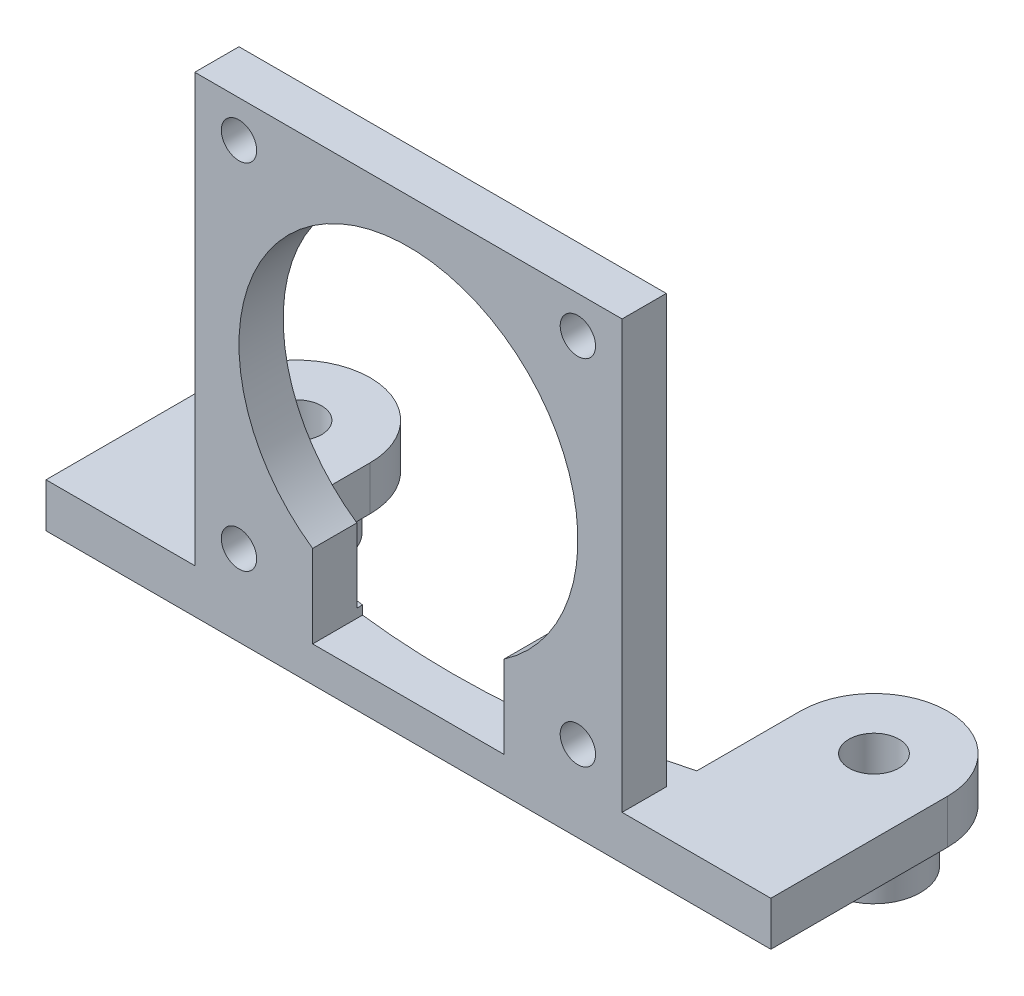
ISO-10303-21;
HEADER;
FILE_DESCRIPTION(('STEP AP214'),'2;1');
FILE_NAME('part.step','',(''),(''),'','','');
FILE_SCHEMA(('AUTOMOTIVE_DESIGN { 1 0 10303 214 1 1 1 1 }'));
ENDSEC;
DATA;
#1=APPLICATION_CONTEXT('core data for automotive mechanical design processes');
#2=APPLICATION_PROTOCOL_DEFINITION('international standard','automotive_design',2000,#1);
#3=PRODUCT_CONTEXT('',#1,'mechanical');
#4=PRODUCT('Part','Part','',(#3));
#5=PRODUCT_RELATED_PRODUCT_CATEGORY('part','',(#4));
#6=PRODUCT_DEFINITION_FORMATION('','',#4);
#7=PRODUCT_DEFINITION_CONTEXT('part definition',#1,'design');
#8=PRODUCT_DEFINITION('design','',#6,#7);
#9=PRODUCT_DEFINITION_SHAPE('','',#8);
#10=(LENGTH_UNIT() NAMED_UNIT(*) SI_UNIT(.MILLI.,.METRE.));
#11=(NAMED_UNIT(*) PLANE_ANGLE_UNIT() SI_UNIT($,.RADIAN.));
#12=(NAMED_UNIT(*) SI_UNIT($,.STERADIAN.) SOLID_ANGLE_UNIT());
#13=UNCERTAINTY_MEASURE_WITH_UNIT(LENGTH_MEASURE(1.E-05),#10,'distance_accuracy_value','');
#14=(GEOMETRIC_REPRESENTATION_CONTEXT(3) GLOBAL_UNCERTAINTY_ASSIGNED_CONTEXT((#13)) GLOBAL_UNIT_ASSIGNED_CONTEXT((#10,
#11,#12)) REPRESENTATION_CONTEXT('',''));
#15=CARTESIAN_POINT('',(0.,0.,0.));
#16=DIRECTION('',(0.,0.,1.));
#17=DIRECTION('',(1.,0.,0.));
#18=AXIS2_PLACEMENT_3D('',#15,#16,#17);
#19=CARTESIAN_POINT('',(0.,0.,0.));
#20=DIRECTION('',(0.,1.,0.));
#21=DIRECTION('',(0.,0.,1.));
#22=AXIS2_PLACEMENT_3D('',#19,#20,#21);
#23=PLANE('',#22);
#24=CARTESIAN_POINT('',(-19.5959179422654,0.,46.));
#25=DIRECTION('',(0.,1.,0.));
#26=DIRECTION('',(0.,0.,1.));
#27=AXIS2_PLACEMENT_3D('',#24,#25,#26);
#28=CIRCLE('',#27,1.7);
#29=CARTESIAN_POINT('',(-19.5959179422654,0.,47.7));
#30=VERTEX_POINT('',#29);
#31=EDGE_CURVE('E329',#30,#30,#28,.T.);
#32=ORIENTED_EDGE('',*,*,#31,.F.);
#33=EDGE_LOOP('',(#32));
#34=FACE_BOUND('',#33,.T.);
#35=DIRECTION('',(-1.,0.,0.));
#36=VECTOR('',#35,1.);
#37=CARTESIAN_POINT('',(0.,0.,55.));
#38=LINE('',#37,#36);
#39=CARTESIAN_POINT('',(-6.5,0.,55.));
#40=VERTEX_POINT('',#39);
#41=CARTESIAN_POINT('',(-14.5,0.,55.));
#42=VERTEX_POINT('',#41);
#43=EDGE_CURVE('E12',#40,#42,#38,.T.);
#44=ORIENTED_EDGE('',*,*,#43,.F.);
#45=DIRECTION('',(0.,0.,1.));
#46=VECTOR('',#45,1.);
#47=CARTESIAN_POINT('',(-6.5,0.,40.999));
#48=LINE('',#47,#46);
#49=CARTESIAN_POINT('',(-6.5,0.,54.6145584986274));
#50=VERTEX_POINT('',#49);
#51=EDGE_CURVE('E136',#50,#40,#48,.T.);
#52=ORIENTED_EDGE('',*,*,#51,.F.);
#53=CARTESIAN_POINT('',(0.,0.,0.));
#54=DIRECTION('',(0.,1.,0.));
#55=DIRECTION('',(0.,0.,1.));
#56=AXIS2_PLACEMENT_3D('',#53,#54,#55);
#57=CIRCLE('',#56,55.);
#58=CARTESIAN_POINT('',(-14.5959179422654,0.,53.0279094385462));
#59=VERTEX_POINT('',#58);
#60=EDGE_CURVE('E318',#59,#50,#57,.T.);
#61=ORIENTED_EDGE('',*,*,#60,.F.);
#62=DIRECTION('',(0.,0.,1.));
#63=VECTOR('',#62,1.);
#64=CARTESIAN_POINT('',(-14.5959179422655,0.,0.));
#65=LINE('',#64,#63);
#66=CARTESIAN_POINT('',(-14.5959179422654,0.,46.));
#67=VERTEX_POINT('',#66);
#68=EDGE_CURVE('E321',#67,#59,#65,.T.);
#69=ORIENTED_EDGE('',*,*,#68,.F.);
#70=CARTESIAN_POINT('',(-19.5959179422654,0.,46.));
#71=DIRECTION('',(0.,1.,0.));
#72=DIRECTION('',(0.,0.,1.));
#73=AXIS2_PLACEMENT_3D('',#70,#71,#72);
#74=CIRCLE('',#73,5.);
#75=CARTESIAN_POINT('',(-24.5959179422654,0.,46.));
#76=VERTEX_POINT('',#75);
#77=EDGE_CURVE('E323',#67,#76,#74,.T.);
#78=ORIENTED_EDGE('',*,*,#77,.T.);
#79=DIRECTION('',(0.,0.,1.));
#80=VECTOR('',#79,1.);
#81=CARTESIAN_POINT('',(-24.5959179422654,0.,0.));
#82=LINE('',#81,#80);
#83=CARTESIAN_POINT('',(-24.5959179422654,0.,58.));
#84=VERTEX_POINT('',#83);
#85=EDGE_CURVE('E326',#76,#84,#82,.T.);
#86=ORIENTED_EDGE('',*,*,#85,.T.);
#87=DIRECTION('',(1.,0.,0.));
#88=VECTOR('',#87,1.);
#89=CARTESIAN_POINT('',(0.,0.,58.));
#90=LINE('',#89,#88);
#91=CARTESIAN_POINT('',(-14.5,0.,58.));
#92=VERTEX_POINT('',#91);
#93=EDGE_CURVE('E309',#84,#92,#90,.T.);
#94=ORIENTED_EDGE('',*,*,#93,.T.);
#95=DIRECTION('',(0.,0.,-1.));
#96=VECTOR('',#95,1.);
#97=CARTESIAN_POINT('',(-14.5,0.,0.));
#98=LINE('',#97,#96);
#99=EDGE_CURVE('E268',#92,#42,#98,.T.);
#100=ORIENTED_EDGE('',*,*,#99,.T.);
#101=EDGE_LOOP('',(#44,#52,#61,#69,#78,#86,#94,#100));
#102=FACE_BOUND('',#101,.T.);
#103=ADVANCED_FACE('F111',(#34,#102),#23,.T.);
#104=CARTESIAN_POINT('',(0.,-3.,58.));
#105=DIRECTION('',(0.,0.,1.));
#106=DIRECTION('',(1.,0.,0.));
#107=AXIS2_PLACEMENT_3D('',#104,#105,#106);
#108=PLANE('',#107);
#109=ORIENTED_EDGE('',*,*,#93,.F.);
#110=DIRECTION('',(0.,1.,0.));
#111=VECTOR('',#110,1.);
#112=CARTESIAN_POINT('',(-24.5959179422654,-3.,58.));
#113=LINE('',#112,#111);
#114=CARTESIAN_POINT('',(-24.5959179422654,-3.,58.));
#115=VERTEX_POINT('',#114);
#116=EDGE_CURVE('E120',#115,#84,#113,.T.);
#117=ORIENTED_EDGE('',*,*,#116,.F.);
#118=DIRECTION('',(1.,0.,0.));
#119=VECTOR('',#118,1.);
#120=CARTESIAN_POINT('',(0.,-3.,58.));
#121=LINE('',#120,#119);
#122=CARTESIAN_POINT('',(24.5959179422654,-3.,58.));
#123=VERTEX_POINT('',#122);
#124=EDGE_CURVE('E288',#115,#123,#121,.T.);
#125=ORIENTED_EDGE('',*,*,#124,.T.);
#126=DIRECTION('',(0.,1.,0.));
#127=VECTOR('',#126,1.);
#128=CARTESIAN_POINT('',(24.5959179422654,-3.,58.));
#129=LINE('',#128,#127);
#130=CARTESIAN_POINT('',(24.5959179422654,0.,58.));
#131=VERTEX_POINT('',#130);
#132=EDGE_CURVE('E115',#123,#131,#129,.T.);
#133=ORIENTED_EDGE('',*,*,#132,.T.);
#134=CARTESIAN_POINT('',(14.5,0.,58.));
#135=VERTEX_POINT('',#134);
#136=EDGE_CURVE('E279',#135,#131,#90,.T.);
#137=ORIENTED_EDGE('',*,*,#136,.F.);
#138=DIRECTION('',(0.,-1.,0.));
#139=VECTOR('',#138,1.);
#140=CARTESIAN_POINT('',(14.5,29.,58.));
#141=LINE('',#140,#139);
#142=CARTESIAN_POINT('',(14.5,29.,58.));
#143=VERTEX_POINT('',#142);
#144=EDGE_CURVE('E280',#143,#135,#141,.T.);
#145=ORIENTED_EDGE('',*,*,#144,.F.);
#146=DIRECTION('',(-1.,0.,0.));
#147=VECTOR('',#146,1.);
#148=CARTESIAN_POINT('',(0.,29.,58.));
#149=LINE('',#148,#147);
#150=CARTESIAN_POINT('',(-14.5,29.,58.));
#151=VERTEX_POINT('',#150);
#152=EDGE_CURVE('E287',#143,#151,#149,.T.);
#153=ORIENTED_EDGE('',*,*,#152,.T.);
#154=DIRECTION('',(0.,-1.,0.));
#155=VECTOR('',#154,1.);
#156=CARTESIAN_POINT('',(-14.5,29.,58.));
#157=LINE('',#156,#155);
#158=EDGE_CURVE('E276',#151,#92,#157,.T.);
#159=ORIENTED_EDGE('',*,*,#158,.T.);
#160=EDGE_LOOP('',(#109,#117,#125,#133,#137,#145,#153,#159));
#161=FACE_BOUND('',#160,.T.);
#162=CARTESIAN_POINT('',(11.5,26.5,58.));
#163=DIRECTION('',(0.,0.,1.));
#164=DIRECTION('',(1.,0.,0.));
#165=AXIS2_PLACEMENT_3D('',#162,#163,#164);
#166=CIRCLE('',#165,1.2);
#167=CARTESIAN_POINT('',(12.7,26.5,58.));
#168=VERTEX_POINT('',#167);
#169=EDGE_CURVE('E272',#168,#168,#166,.F.);
#170=ORIENTED_EDGE('',*,*,#169,.T.);
#171=EDGE_LOOP('',(#170));
#172=FACE_BOUND('',#171,.T.);
#173=CARTESIAN_POINT('',(11.5,2.49999999999995,58.));
#174=DIRECTION('',(0.,0.,1.));
#175=DIRECTION('',(1.,0.,0.));
#176=AXIS2_PLACEMENT_3D('',#173,#174,#175);
#177=CIRCLE('',#176,1.2);
#178=CARTESIAN_POINT('',(12.7,2.49999999999995,58.));
#179=VERTEX_POINT('',#178);
#180=EDGE_CURVE('E390',#179,#179,#177,.F.);
#181=ORIENTED_EDGE('',*,*,#180,.T.);
#182=EDGE_LOOP('',(#181));
#183=FACE_BOUND('',#182,.T.);
#184=CARTESIAN_POINT('',(0.,14.5,58.));
#185=DIRECTION('',(0.,0.,1.));
#186=DIRECTION('',(1.,0.,0.));
#187=AXIS2_PLACEMENT_3D('',#184,#185,#186);
#188=CIRCLE('',#187,11.5);
#189=CARTESIAN_POINT('',(6.5,5.01316701949481,58.));
#190=VERTEX_POINT('',#189);
#191=CARTESIAN_POINT('',(-6.5,5.01316701949483,58.));
#192=VERTEX_POINT('',#191);
#193=EDGE_CURVE('E417',#190,#192,#188,.T.);
#194=ORIENTED_EDGE('',*,*,#193,.F.);
#195=DIRECTION('',(0.,1.,0.));
#196=VECTOR('',#195,1.);
#197=CARTESIAN_POINT('',(6.5,0.,58.));
#198=LINE('',#197,#196);
#199=CARTESIAN_POINT('',(6.5,-0.6,58.));
#200=VERTEX_POINT('',#199);
#201=EDGE_CURVE('E407',#200,#190,#198,.T.);
#202=ORIENTED_EDGE('',*,*,#201,.F.);
#203=DIRECTION('',(1.,0.,0.));
#204=VECTOR('',#203,1.);
#205=CARTESIAN_POINT('',(0.,-0.6,58.));
#206=LINE('',#205,#204);
#207=CARTESIAN_POINT('',(-6.5,-0.6,58.));
#208=VERTEX_POINT('',#207);
#209=EDGE_CURVE('E413',#208,#200,#206,.T.);
#210=ORIENTED_EDGE('',*,*,#209,.F.);
#211=DIRECTION('',(0.,1.,0.));
#212=VECTOR('',#211,1.);
#213=CARTESIAN_POINT('',(-6.5,0.,58.));
#214=LINE('',#213,#212);
#215=EDGE_CURVE('E129',#208,#192,#214,.T.);
#216=ORIENTED_EDGE('',*,*,#215,.T.);
#217=EDGE_LOOP('',(#194,#202,#210,#216));
#218=FACE_BOUND('',#217,.T.);
#219=CARTESIAN_POINT('',(-11.5,2.49999999999995,58.));
#220=DIRECTION('',(0.,0.,1.));
#221=DIRECTION('',(1.,0.,0.));
#222=AXIS2_PLACEMENT_3D('',#219,#220,#221);
#223=CIRCLE('',#222,1.2);
#224=CARTESIAN_POINT('',(-10.3,2.49999999999995,58.));
#225=VERTEX_POINT('',#224);
#226=EDGE_CURVE('E387',#225,#225,#223,.T.);
#227=ORIENTED_EDGE('',*,*,#226,.F.);
#228=EDGE_LOOP('',(#227));
#229=FACE_BOUND('',#228,.T.);
#230=CARTESIAN_POINT('',(-11.5,26.5,58.));
#231=DIRECTION('',(0.,0.,1.));
#232=DIRECTION('',(1.,0.,0.));
#233=AXIS2_PLACEMENT_3D('',#230,#231,#232);
#234=CIRCLE('',#233,1.2);
#235=CARTESIAN_POINT('',(-10.3,26.5,58.));
#236=VERTEX_POINT('',#235);
#237=EDGE_CURVE('E386',#236,#236,#234,.T.);
#238=ORIENTED_EDGE('',*,*,#237,.F.);
#239=EDGE_LOOP('',(#238));
#240=FACE_BOUND('',#239,.T.);
#241=ADVANCED_FACE('F113',(#161,#172,#183,#218,#229,#240),#108,.T.);
#242=CARTESIAN_POINT('',(0.,29.,55.));
#243=DIRECTION('',(0.,0.,1.));
#244=DIRECTION('',(1.,0.,0.));
#245=AXIS2_PLACEMENT_3D('',#242,#243,#244);
#246=PLANE('',#245);
#247=CARTESIAN_POINT('',(-11.5,2.49999999999995,55.));
#248=DIRECTION('',(0.,0.,1.));
#249=DIRECTION('',(1.,0.,0.));
#250=AXIS2_PLACEMENT_3D('',#247,#248,#249);
#251=CIRCLE('',#250,1.2);
#252=CARTESIAN_POINT('',(-10.3,2.49999999999995,55.));
#253=VERTEX_POINT('',#252);
#254=EDGE_CURVE('E383',#253,#253,#251,.F.);
#255=ORIENTED_EDGE('',*,*,#254,.F.);
#256=EDGE_LOOP('',(#255));
#257=FACE_BOUND('',#256,.T.);
#258=CARTESIAN_POINT('',(11.5,2.49999999999995,55.));
#259=DIRECTION('',(0.,0.,1.));
#260=DIRECTION('',(1.,0.,0.));
#261=AXIS2_PLACEMENT_3D('',#258,#259,#260);
#262=CIRCLE('',#261,1.2);
#263=CARTESIAN_POINT('',(12.7,2.49999999999995,55.));
#264=VERTEX_POINT('',#263);
#265=EDGE_CURVE('E258',#264,#264,#262,.T.);
#266=ORIENTED_EDGE('',*,*,#265,.T.);
#267=EDGE_LOOP('',(#266));
#268=FACE_BOUND('',#267,.T.);
#269=CARTESIAN_POINT('',(11.5,26.5,55.));
#270=DIRECTION('',(0.,0.,1.));
#271=DIRECTION('',(1.,0.,0.));
#272=AXIS2_PLACEMENT_3D('',#269,#270,#271);
#273=CIRCLE('',#272,1.2);
#274=CARTESIAN_POINT('',(12.7,26.5,55.));
#275=VERTEX_POINT('',#274);
#276=EDGE_CURVE('E377',#275,#275,#273,.T.);
#277=ORIENTED_EDGE('',*,*,#276,.T.);
#278=EDGE_LOOP('',(#277));
#279=FACE_BOUND('',#278,.T.);
#280=CARTESIAN_POINT('',(14.5,0.,55.));
#281=VERTEX_POINT('',#280);
#282=CARTESIAN_POINT('',(6.5,0.,55.));
#283=VERTEX_POINT('',#282);
#284=EDGE_CURVE('E122',#281,#283,#38,.T.);
#285=ORIENTED_EDGE('',*,*,#284,.T.);
#286=DIRECTION('',(0.,-1.,0.));
#287=VECTOR('',#286,1.);
#288=CARTESIAN_POINT('',(6.5,0.,55.));
#289=LINE('',#288,#287);
#290=CARTESIAN_POINT('',(6.5,5.01316701949481,55.));
#291=VERTEX_POINT('',#290);
#292=EDGE_CURVE('E238',#291,#283,#289,.T.);
#293=ORIENTED_EDGE('',*,*,#292,.F.);
#294=CARTESIAN_POINT('',(0.,14.5,55.));
#295=DIRECTION('',(0.,0.,1.));
#296=DIRECTION('',(1.,0.,0.));
#297=AXIS2_PLACEMENT_3D('',#294,#295,#296);
#298=CIRCLE('',#297,11.5);
#299=CARTESIAN_POINT('',(-6.5,5.01316701949483,55.));
#300=VERTEX_POINT('',#299);
#301=EDGE_CURVE('E249',#300,#291,#298,.F.);
#302=ORIENTED_EDGE('',*,*,#301,.F.);
#303=DIRECTION('',(0.,-1.,0.));
#304=VECTOR('',#303,1.);
#305=CARTESIAN_POINT('',(-6.5,0.,55.));
#306=LINE('',#305,#304);
#307=EDGE_CURVE('E402',#300,#40,#306,.T.);
#308=ORIENTED_EDGE('',*,*,#307,.T.);
#309=ORIENTED_EDGE('',*,*,#43,.T.);
#310=DIRECTION('',(0.,-1.,0.));
#311=VECTOR('',#310,1.);
#312=CARTESIAN_POINT('',(-14.5,29.,55.));
#313=LINE('',#312,#311);
#314=CARTESIAN_POINT('',(-14.5,29.,55.));
#315=VERTEX_POINT('',#314);
#316=EDGE_CURVE('E284',#315,#42,#313,.T.);
#317=ORIENTED_EDGE('',*,*,#316,.F.);
#318=DIRECTION('',(-1.,0.,0.));
#319=VECTOR('',#318,1.);
#320=CARTESIAN_POINT('',(0.,29.,55.));
#321=LINE('',#320,#319);
#322=CARTESIAN_POINT('',(14.5,29.,55.));
#323=VERTEX_POINT('',#322);
#324=EDGE_CURVE('E371',#323,#315,#321,.T.);
#325=ORIENTED_EDGE('',*,*,#324,.F.);
#326=DIRECTION('',(0.,-1.,0.));
#327=VECTOR('',#326,1.);
#328=CARTESIAN_POINT('',(14.5,29.,55.));
#329=LINE('',#328,#327);
#330=EDGE_CURVE('E266',#323,#281,#329,.T.);
#331=ORIENTED_EDGE('',*,*,#330,.T.);
#332=EDGE_LOOP('',(#285,#293,#302,#308,#309,#317,#325,#331));
#333=FACE_BOUND('',#332,.T.);
#334=CARTESIAN_POINT('',(-11.5,26.5,55.));
#335=DIRECTION('',(0.,0.,1.));
#336=DIRECTION('',(1.,0.,0.));
#337=AXIS2_PLACEMENT_3D('',#334,#335,#336);
#338=CIRCLE('',#337,1.2);
#339=CARTESIAN_POINT('',(-10.3,26.5,55.));
#340=VERTEX_POINT('',#339);
#341=EDGE_CURVE('E380',#340,#340,#338,.F.);
#342=ORIENTED_EDGE('',*,*,#341,.F.);
#343=EDGE_LOOP('',(#342));
#344=FACE_BOUND('',#343,.T.);
#345=ADVANCED_FACE('F262',(#257,#268,#279,#333,#344),#246,.F.);
#346=CARTESIAN_POINT('',(-24.5959179422654,-3.,0.));
#347=DIRECTION('',(-1.,0.,0.));
#348=DIRECTION('',(0.,0.,1.));
#349=AXIS2_PLACEMENT_3D('',#346,#347,#348);
#350=PLANE('',#349);
#351=ORIENTED_EDGE('',*,*,#85,.F.);
#352=DIRECTION('',(0.,1.,0.));
#353=VECTOR('',#352,1.);
#354=CARTESIAN_POINT('',(-24.5959179422654,-3.,46.));
#355=LINE('',#354,#353);
#356=CARTESIAN_POINT('',(-24.5959179422654,-3.,46.));
#357=VERTEX_POINT('',#356);
#358=EDGE_CURVE('E335',#357,#76,#355,.T.);
#359=ORIENTED_EDGE('',*,*,#358,.F.);
#360=DIRECTION('',(0.,0.,1.));
#361=VECTOR('',#360,1.);
#362=CARTESIAN_POINT('',(-24.5959179422654,-3.,0.));
#363=LINE('',#362,#361);
#364=EDGE_CURVE('E306',#357,#115,#363,.T.);
#365=ORIENTED_EDGE('',*,*,#364,.T.);
#366=ORIENTED_EDGE('',*,*,#116,.T.);
#367=EDGE_LOOP('',(#351,#359,#365,#366));
#368=FACE_BOUND('',#367,.T.);
#369=ADVANCED_FACE('F482',(#368),#350,.T.);
#370=CARTESIAN_POINT('',(-19.5959179422654,-3.,46.));
#371=DIRECTION('',(0.,1.,0.));
#372=DIRECTION('',(0.,0.,1.));
#373=AXIS2_PLACEMENT_3D('',#370,#371,#372);
#374=CYLINDRICAL_SURFACE('',#373,5.);
#375=ORIENTED_EDGE('',*,*,#77,.F.);
#376=DIRECTION('',(0.,1.,0.));
#377=VECTOR('',#376,1.);
#378=CARTESIAN_POINT('',(-14.5959179422654,-3.,46.));
#379=LINE('',#378,#377);
#380=CARTESIAN_POINT('',(-14.5959179422654,-3.,46.));
#381=VERTEX_POINT('',#380);
#382=EDGE_CURVE('E337',#381,#67,#379,.T.);
#383=ORIENTED_EDGE('',*,*,#382,.F.);
#384=CARTESIAN_POINT('',(-19.5959179422654,-3.,46.));
#385=DIRECTION('',(0.,1.,0.));
#386=DIRECTION('',(0.,0.,1.));
#387=AXIS2_PLACEMENT_3D('',#384,#385,#386);
#388=CIRCLE('',#387,5.);
#389=EDGE_CURVE('E303',#381,#357,#388,.T.);
#390=ORIENTED_EDGE('',*,*,#389,.T.);
#391=ORIENTED_EDGE('',*,*,#358,.T.);
#392=EDGE_LOOP('',(#375,#383,#390,#391));
#393=FACE_BOUND('',#392,.T.);
#394=ADVANCED_FACE('F633',(#393),#374,.T.);
#395=CARTESIAN_POINT('',(-14.5959179422655,-3.,0.));
#396=DIRECTION('',(-1.,0.,0.));
#397=DIRECTION('',(0.,0.,1.));
#398=AXIS2_PLACEMENT_3D('',#395,#396,#397);
#399=PLANE('',#398);
#400=ORIENTED_EDGE('',*,*,#68,.T.);
#401=DIRECTION('',(0.,1.,0.));
#402=VECTOR('',#401,1.);
#403=CARTESIAN_POINT('',(-14.5959179422654,-3.,53.0279094385462));
#404=LINE('',#403,#402);
#405=CARTESIAN_POINT('',(-14.5959179422654,-3.,53.0279094385462));
#406=VERTEX_POINT('',#405);
#407=EDGE_CURVE('E339',#406,#59,#404,.T.);
#408=ORIENTED_EDGE('',*,*,#407,.F.);
#409=DIRECTION('',(0.,0.,1.));
#410=VECTOR('',#409,1.);
#411=CARTESIAN_POINT('',(-14.5959179422655,-3.,0.));
#412=LINE('',#411,#410);
#413=EDGE_CURVE('E301',#381,#406,#412,.T.);
#414=ORIENTED_EDGE('',*,*,#413,.F.);
#415=ORIENTED_EDGE('',*,*,#382,.T.);
#416=EDGE_LOOP('',(#400,#408,#414,#415));
#417=FACE_BOUND('',#416,.T.);
#418=ADVANCED_FACE('F628',(#417),#399,.F.);
#419=CARTESIAN_POINT('',(0.,-3.,0.));
#420=DIRECTION('',(0.,1.,0.));
#421=DIRECTION('',(0.,0.,1.));
#422=AXIS2_PLACEMENT_3D('',#419,#420,#421);
#423=CYLINDRICAL_SURFACE('',#422,55.);
#424=CARTESIAN_POINT('',(0.,-0.6,0.));
#425=DIRECTION('',(0.,-1.,0.));
#426=DIRECTION('',(0.,0.,-1.));
#427=AXIS2_PLACEMENT_3D('',#424,#425,#426);
#428=CIRCLE('',#427,55.);
#429=CARTESIAN_POINT('',(6.5,-0.6,54.6145584986274));
#430=VERTEX_POINT('',#429);
#431=CARTESIAN_POINT('',(-6.5,-0.6,54.6145584986274));
#432=VERTEX_POINT('',#431);
#433=EDGE_CURVE('E248',#430,#432,#428,.T.);
#434=ORIENTED_EDGE('',*,*,#433,.F.);
#435=DIRECTION('',(0.,1.,0.));
#436=VECTOR('',#435,1.);
#437=CARTESIAN_POINT('',(6.5,-3.,54.6145584986274));
#438=LINE('',#437,#436);
#439=CARTESIAN_POINT('',(6.5,0.,54.6145584986274));
#440=VERTEX_POINT('',#439);
#441=EDGE_CURVE('E420',#440,#430,#438,.F.);
#442=ORIENTED_EDGE('',*,*,#441,.F.);
#443=CARTESIAN_POINT('',(14.5959179422654,0.,53.0279094385462));
#444=VERTEX_POINT('',#443);
#445=EDGE_CURVE('E257',#440,#444,#57,.T.);
#446=ORIENTED_EDGE('',*,*,#445,.T.);
#447=DIRECTION('',(0.,1.,0.));
#448=VECTOR('',#447,1.);
#449=CARTESIAN_POINT('',(14.5959179422654,-3.,53.0279094385462));
#450=LINE('',#449,#448);
#451=CARTESIAN_POINT('',(14.5959179422654,-3.,53.0279094385462));
#452=VERTEX_POINT('',#451);
#453=EDGE_CURVE('E342',#452,#444,#450,.T.);
#454=ORIENTED_EDGE('',*,*,#453,.F.);
#455=CARTESIAN_POINT('',(0.,-3.,0.));
#456=DIRECTION('',(0.,1.,0.));
#457=DIRECTION('',(0.,0.,1.));
#458=AXIS2_PLACEMENT_3D('',#455,#456,#457);
#459=CIRCLE('',#458,55.);
#460=EDGE_CURVE('E299',#406,#452,#459,.T.);
#461=ORIENTED_EDGE('',*,*,#460,.F.);
#462=ORIENTED_EDGE('',*,*,#407,.T.);
#463=ORIENTED_EDGE('',*,*,#60,.T.);
#464=DIRECTION('',(0.,1.,0.));
#465=VECTOR('',#464,1.);
#466=CARTESIAN_POINT('',(-6.5,-3.,54.6145584986274));
#467=LINE('',#466,#465);
#468=EDGE_CURVE('E259',#50,#432,#467,.F.);
#469=ORIENTED_EDGE('',*,*,#468,.T.);
#470=EDGE_LOOP('',(#434,#442,#446,#454,#461,#462,#463,#469));
#471=FACE_BOUND('',#470,.T.);
#472=ADVANCED_FACE('F620',(#471),#423,.F.);
#473=CARTESIAN_POINT('',(14.5959179422655,-3.,0.));
#474=DIRECTION('',(-1.,0.,0.));
#475=DIRECTION('',(0.,0.,1.));
#476=AXIS2_PLACEMENT_3D('',#473,#474,#475);
#477=PLANE('',#476);
#478=DIRECTION('',(0.,0.,1.));
#479=VECTOR('',#478,1.);
#480=CARTESIAN_POINT('',(14.5959179422655,0.,0.));
#481=LINE('',#480,#479);
#482=CARTESIAN_POINT('',(14.5959179422656,0.,46.));
#483=VERTEX_POINT('',#482);
#484=EDGE_CURVE('E316',#483,#444,#481,.T.);
#485=ORIENTED_EDGE('',*,*,#484,.F.);
#486=DIRECTION('',(0.,1.,0.));
#487=VECTOR('',#486,1.);
#488=CARTESIAN_POINT('',(14.5959179422656,-3.,46.));
#489=LINE('',#488,#487);
#490=CARTESIAN_POINT('',(14.5959179422656,-3.,46.));
#491=VERTEX_POINT('',#490);
#492=EDGE_CURVE('E345',#491,#483,#489,.T.);
#493=ORIENTED_EDGE('',*,*,#492,.F.);
#494=DIRECTION('',(0.,0.,1.));
#495=VECTOR('',#494,1.);
#496=CARTESIAN_POINT('',(14.5959179422655,-3.,0.));
#497=LINE('',#496,#495);
#498=EDGE_CURVE('E296',#491,#452,#497,.T.);
#499=ORIENTED_EDGE('',*,*,#498,.T.);
#500=ORIENTED_EDGE('',*,*,#453,.T.);
#501=EDGE_LOOP('',(#485,#493,#499,#500));
#502=FACE_BOUND('',#501,.T.);
#503=ADVANCED_FACE('F609',(#502),#477,.T.);
#504=CARTESIAN_POINT('',(19.5959179422654,-3.,46.));
#505=DIRECTION('',(0.,1.,0.));
#506=DIRECTION('',(0.,0.,1.));
#507=AXIS2_PLACEMENT_3D('',#504,#505,#506);
#508=CYLINDRICAL_SURFACE('',#507,4.9999999999997);
#509=CARTESIAN_POINT('',(19.5959179422654,0.,46.));
#510=DIRECTION('',(0.,1.,0.));
#511=DIRECTION('',(0.,0.,1.));
#512=AXIS2_PLACEMENT_3D('',#509,#510,#511);
#513=CIRCLE('',#512,4.9999999999997);
#514=CARTESIAN_POINT('',(24.5959179422653,0.,46.));
#515=VERTEX_POINT('',#514);
#516=EDGE_CURVE('E314',#483,#515,#513,.F.);
#517=ORIENTED_EDGE('',*,*,#516,.T.);
#518=DIRECTION('',(0.,1.,0.));
#519=VECTOR('',#518,1.);
#520=CARTESIAN_POINT('',(24.5959179422653,-3.,46.));
#521=LINE('',#520,#519);
#522=CARTESIAN_POINT('',(24.5959179422653,-3.,46.));
#523=VERTEX_POINT('',#522);
#524=EDGE_CURVE('E346',#523,#515,#521,.T.);
#525=ORIENTED_EDGE('',*,*,#524,.F.);
#526=CARTESIAN_POINT('',(19.5959179422654,-3.,46.));
#527=DIRECTION('',(0.,1.,0.));
#528=DIRECTION('',(0.,0.,1.));
#529=AXIS2_PLACEMENT_3D('',#526,#527,#528);
#530=CIRCLE('',#529,4.9999999999997);
#531=EDGE_CURVE('E294',#491,#523,#530,.F.);
#532=ORIENTED_EDGE('',*,*,#531,.F.);
#533=ORIENTED_EDGE('',*,*,#492,.T.);
#534=EDGE_LOOP('',(#517,#525,#532,#533));
#535=FACE_BOUND('',#534,.T.);
#536=ADVANCED_FACE('F604',(#535),#508,.T.);
#537=CARTESIAN_POINT('',(-19.5959179422654,-3.,46.));
#538=DIRECTION('',(0.,1.,0.));
#539=DIRECTION('',(0.,0.,1.));
#540=AXIS2_PLACEMENT_3D('',#537,#538,#539);
#541=CYLINDRICAL_SURFACE('',#540,1.7);
#542=ORIENTED_EDGE('',*,*,#31,.T.);
#543=EDGE_LOOP('',(#542));
#544=FACE_BOUND('',#543,.T.);
#545=CARTESIAN_POINT('',(-19.5959179422654,-6.6,46.));
#546=DIRECTION('',(0.,1.,0.));
#547=DIRECTION('',(0.,0.,1.));
#548=AXIS2_PLACEMENT_3D('',#545,#546,#547);
#549=CIRCLE('',#548,1.7);
#550=CARTESIAN_POINT('',(-19.5959179422654,-6.6,47.7));
#551=VERTEX_POINT('',#550);
#552=EDGE_CURVE('E428',#551,#551,#549,.T.);
#553=ORIENTED_EDGE('',*,*,#552,.F.);
#554=EDGE_LOOP('',(#553));
#555=FACE_BOUND('',#554,.T.);
#556=ADVANCED_FACE('F457',(#544,#555),#541,.F.);
#557=CARTESIAN_POINT('',(24.5959179422654,-3.,0.));
#558=DIRECTION('',(-1.,0.,0.));
#559=DIRECTION('',(0.,0.,1.));
#560=AXIS2_PLACEMENT_3D('',#557,#558,#559);
#561=PLANE('',#560);
#562=DIRECTION('',(0.,0.,1.));
#563=VECTOR('',#562,1.);
#564=CARTESIAN_POINT('',(24.5959179422654,0.,0.));
#565=LINE('',#564,#563);
#566=EDGE_CURVE('E311',#515,#131,#565,.T.);
#567=ORIENTED_EDGE('',*,*,#566,.T.);
#568=ORIENTED_EDGE('',*,*,#132,.F.);
#569=DIRECTION('',(0.,0.,1.));
#570=VECTOR('',#569,1.);
#571=CARTESIAN_POINT('',(24.5959179422654,-3.,0.));
#572=LINE('',#571,#570);
#573=EDGE_CURVE('E291',#523,#123,#572,.T.);
#574=ORIENTED_EDGE('',*,*,#573,.F.);
#575=ORIENTED_EDGE('',*,*,#524,.T.);
#576=EDGE_LOOP('',(#567,#568,#574,#575));
#577=FACE_BOUND('',#576,.T.);
#578=ADVANCED_FACE('F359',(#577),#561,.F.);
#579=CARTESIAN_POINT('',(19.5959179422654,-3.,46.));
#580=DIRECTION('',(0.,1.,0.));
#581=DIRECTION('',(0.,0.,1.));
#582=AXIS2_PLACEMENT_3D('',#579,#580,#581);
#583=CYLINDRICAL_SURFACE('',#582,1.69999999999969);
#584=CARTESIAN_POINT('',(19.5959179422654,0.,46.));
#585=DIRECTION('',(0.,1.,0.));
#586=DIRECTION('',(0.,0.,1.));
#587=AXIS2_PLACEMENT_3D('',#584,#585,#586);
#588=CIRCLE('',#587,1.69999999999969);
#589=CARTESIAN_POINT('',(19.5959179422654,0.,47.6999999999997));
#590=VERTEX_POINT('',#589);
#591=EDGE_CURVE('E292',#590,#590,#588,.F.);
#592=ORIENTED_EDGE('',*,*,#591,.F.);
#593=EDGE_LOOP('',(#592));
#594=FACE_BOUND('',#593,.T.);
#595=CARTESIAN_POINT('',(19.5959179422654,-6.6,46.));
#596=DIRECTION('',(0.,1.,0.));
#597=DIRECTION('',(0.,0.,1.));
#598=AXIS2_PLACEMENT_3D('',#595,#596,#597);
#599=CIRCLE('',#598,1.69999999999969);
#600=CARTESIAN_POINT('',(19.5959179422654,-6.6,47.6999999999997));
#601=VERTEX_POINT('',#600);
#602=EDGE_CURVE('E437',#601,#601,#599,.T.);
#603=ORIENTED_EDGE('',*,*,#602,.F.);
#604=EDGE_LOOP('',(#603));
#605=FACE_BOUND('',#604,.T.);
#606=ADVANCED_FACE('F446',(#594,#605),#583,.F.);
#607=CARTESIAN_POINT('',(0.,-3.,0.));
#608=DIRECTION('',(0.,1.,0.));
#609=DIRECTION('',(0.,0.,1.));
#610=AXIS2_PLACEMENT_3D('',#607,#608,#609);
#611=PLANE('',#610);
#612=CARTESIAN_POINT('',(19.5959179422654,-3.,46.));
#613=DIRECTION('',(0.,1.,0.));
#614=DIRECTION('',(0.,0.,1.));
#615=AXIS2_PLACEMENT_3D('',#612,#613,#614);
#616=CIRCLE('',#615,3.15);
#617=CARTESIAN_POINT('',(19.5959179422654,-3.,49.15));
#618=VERTEX_POINT('',#617);
#619=EDGE_CURVE('E434',#618,#618,#616,.T.);
#620=ORIENTED_EDGE('',*,*,#619,.T.);
#621=EDGE_LOOP('',(#620));
#622=FACE_BOUND('',#621,.T.);
#623=CARTESIAN_POINT('',(-19.5959179422654,-3.,46.));
#624=DIRECTION('',(0.,1.,0.));
#625=DIRECTION('',(0.,0.,1.));
#626=AXIS2_PLACEMENT_3D('',#623,#624,#625);
#627=CIRCLE('',#626,3.15);
#628=CARTESIAN_POINT('',(-19.5959179422654,-3.,49.15));
#629=VERTEX_POINT('',#628);
#630=EDGE_CURVE('E425',#629,#629,#627,.T.);
#631=ORIENTED_EDGE('',*,*,#630,.T.);
#632=EDGE_LOOP('',(#631));
#633=FACE_BOUND('',#632,.T.);
#634=ORIENTED_EDGE('',*,*,#124,.F.);
#635=ORIENTED_EDGE('',*,*,#364,.F.);
#636=ORIENTED_EDGE('',*,*,#389,.F.);
#637=ORIENTED_EDGE('',*,*,#413,.T.);
#638=ORIENTED_EDGE('',*,*,#460,.T.);
#639=ORIENTED_EDGE('',*,*,#498,.F.);
#640=ORIENTED_EDGE('',*,*,#531,.T.);
#641=ORIENTED_EDGE('',*,*,#573,.T.);
#642=EDGE_LOOP('',(#634,#635,#636,#637,#638,#639,#640,#641));
#643=FACE_BOUND('',#642,.T.);
#644=ADVANCED_FACE('F448',(#622,#633,#643),#611,.F.);
#645=DIRECTION('',(0.,0.,1.));
#646=VECTOR('',#645,1.);
#647=CARTESIAN_POINT('',(6.5,0.,40.999));
#648=LINE('',#647,#646);
#649=EDGE_CURVE('E241',#440,#283,#648,.T.);
#650=ORIENTED_EDGE('',*,*,#649,.T.);
#651=ORIENTED_EDGE('',*,*,#284,.F.);
#652=DIRECTION('',(0.,0.,-1.));
#653=VECTOR('',#652,1.);
#654=CARTESIAN_POINT('',(14.5,0.,0.));
#655=LINE('',#654,#653);
#656=EDGE_CURVE('E267',#135,#281,#655,.T.);
#657=ORIENTED_EDGE('',*,*,#656,.F.);
#658=ORIENTED_EDGE('',*,*,#136,.T.);
#659=ORIENTED_EDGE('',*,*,#566,.F.);
#660=ORIENTED_EDGE('',*,*,#516,.F.);
#661=ORIENTED_EDGE('',*,*,#484,.T.);
#662=ORIENTED_EDGE('',*,*,#445,.F.);
#663=EDGE_LOOP('',(#650,#651,#657,#658,#659,#660,#661,#662));
#664=FACE_BOUND('',#663,.T.);
#665=ORIENTED_EDGE('',*,*,#591,.T.);
#666=EDGE_LOOP('',(#665));
#667=FACE_BOUND('',#666,.T.);
#668=ADVANCED_FACE('F253',(#664,#667),#23,.T.);
#669=CARTESIAN_POINT('',(-14.5,29.,0.));
#670=DIRECTION('',(-1.,0.,0.));
#671=DIRECTION('',(0.,0.,1.));
#672=AXIS2_PLACEMENT_3D('',#669,#670,#671);
#673=PLANE('',#672);
#674=ORIENTED_EDGE('',*,*,#99,.F.);
#675=ORIENTED_EDGE('',*,*,#158,.F.);
#676=DIRECTION('',(0.,0.,-1.));
#677=VECTOR('',#676,1.);
#678=CARTESIAN_POINT('',(-14.5,29.,0.));
#679=LINE('',#678,#677);
#680=EDGE_CURVE('E269',#151,#315,#679,.T.);
#681=ORIENTED_EDGE('',*,*,#680,.T.);
#682=ORIENTED_EDGE('',*,*,#316,.T.);
#683=EDGE_LOOP('',(#674,#675,#681,#682));
#684=FACE_BOUND('',#683,.T.);
#685=ADVANCED_FACE('F469',(#684),#673,.T.);
#686=CARTESIAN_POINT('',(14.5,29.,0.));
#687=DIRECTION('',(-1.,0.,0.));
#688=DIRECTION('',(0.,0.,1.));
#689=AXIS2_PLACEMENT_3D('',#686,#687,#688);
#690=PLANE('',#689);
#691=ORIENTED_EDGE('',*,*,#656,.T.);
#692=ORIENTED_EDGE('',*,*,#330,.F.);
#693=DIRECTION('',(0.,0.,-1.));
#694=VECTOR('',#693,1.);
#695=CARTESIAN_POINT('',(14.5,29.,0.));
#696=LINE('',#695,#694);
#697=EDGE_CURVE('E365',#143,#323,#696,.T.);
#698=ORIENTED_EDGE('',*,*,#697,.F.);
#699=ORIENTED_EDGE('',*,*,#144,.T.);
#700=EDGE_LOOP('',(#691,#692,#698,#699));
#701=FACE_BOUND('',#700,.T.);
#702=ADVANCED_FACE('F363',(#701),#690,.F.);
#703=CARTESIAN_POINT('',(0.,29.,0.));
#704=DIRECTION('',(0.,1.,0.));
#705=DIRECTION('',(0.,0.,1.));
#706=AXIS2_PLACEMENT_3D('',#703,#704,#705);
#707=PLANE('',#706);
#708=ORIENTED_EDGE('',*,*,#680,.F.);
#709=ORIENTED_EDGE('',*,*,#152,.F.);
#710=ORIENTED_EDGE('',*,*,#697,.T.);
#711=ORIENTED_EDGE('',*,*,#324,.T.);
#712=EDGE_LOOP('',(#708,#709,#710,#711));
#713=FACE_BOUND('',#712,.T.);
#714=ADVANCED_FACE('F478',(#713),#707,.T.);
#715=CARTESIAN_POINT('',(11.5,26.5,40.999));
#716=DIRECTION('',(0.,0.,1.));
#717=DIRECTION('',(1.,0.,0.));
#718=AXIS2_PLACEMENT_3D('',#715,#716,#717);
#719=CYLINDRICAL_SURFACE('',#718,1.2);
#720=ORIENTED_EDGE('',*,*,#169,.F.);
#721=EDGE_LOOP('',(#720));
#722=FACE_BOUND('',#721,.T.);
#723=ORIENTED_EDGE('',*,*,#276,.F.);
#724=EDGE_LOOP('',(#723));
#725=FACE_BOUND('',#724,.T.);
#726=ADVANCED_FACE('F487',(#722,#725),#719,.F.);
#727=CARTESIAN_POINT('',(11.5,2.49999999999995,40.999));
#728=DIRECTION('',(0.,0.,1.));
#729=DIRECTION('',(1.,0.,0.));
#730=AXIS2_PLACEMENT_3D('',#727,#728,#729);
#731=CYLINDRICAL_SURFACE('',#730,1.2);
#732=ORIENTED_EDGE('',*,*,#180,.F.);
#733=EDGE_LOOP('',(#732));
#734=FACE_BOUND('',#733,.T.);
#735=ORIENTED_EDGE('',*,*,#265,.F.);
#736=EDGE_LOOP('',(#735));
#737=FACE_BOUND('',#736,.T.);
#738=ADVANCED_FACE('F490',(#734,#737),#731,.F.);
#739=CARTESIAN_POINT('',(0.,14.5,40.999));
#740=DIRECTION('',(0.,0.,1.));
#741=DIRECTION('',(1.,0.,0.));
#742=AXIS2_PLACEMENT_3D('',#739,#740,#741);
#743=CYLINDRICAL_SURFACE('',#742,11.5);
#744=ORIENTED_EDGE('',*,*,#301,.T.);
#745=DIRECTION('',(0.,0.,1.));
#746=VECTOR('',#745,1.);
#747=CARTESIAN_POINT('',(6.5,5.01316701949481,40.999));
#748=LINE('',#747,#746);
#749=EDGE_CURVE('E244',#291,#190,#748,.T.);
#750=ORIENTED_EDGE('',*,*,#749,.T.);
#751=ORIENTED_EDGE('',*,*,#193,.T.);
#752=DIRECTION('',(0.,0.,1.));
#753=VECTOR('',#752,1.);
#754=CARTESIAN_POINT('',(-6.5,5.01316701949483,40.999));
#755=LINE('',#754,#753);
#756=EDGE_CURVE('E404',#300,#192,#755,.T.);
#757=ORIENTED_EDGE('',*,*,#756,.F.);
#758=EDGE_LOOP('',(#744,#750,#751,#757));
#759=FACE_BOUND('',#758,.T.);
#760=ADVANCED_FACE('F504',(#759),#743,.F.);
#761=CARTESIAN_POINT('',(6.5,0.,40.999));
#762=DIRECTION('',(1.,0.,0.));
#763=DIRECTION('',(0.,1.,0.));
#764=AXIS2_PLACEMENT_3D('',#761,#762,#763);
#765=PLANE('',#764);
#766=ORIENTED_EDGE('',*,*,#441,.T.);
#767=DIRECTION('',(0.,0.,1.));
#768=VECTOR('',#767,1.);
#769=CARTESIAN_POINT('',(6.5,-0.6,40.999));
#770=LINE('',#769,#768);
#771=EDGE_CURVE('E409',#430,#200,#770,.T.);
#772=ORIENTED_EDGE('',*,*,#771,.T.);
#773=ORIENTED_EDGE('',*,*,#201,.T.);
#774=ORIENTED_EDGE('',*,*,#749,.F.);
#775=ORIENTED_EDGE('',*,*,#292,.T.);
#776=ORIENTED_EDGE('',*,*,#649,.F.);
#777=EDGE_LOOP('',(#766,#772,#773,#774,#775,#776));
#778=FACE_BOUND('',#777,.T.);
#779=ADVANCED_FACE('F240',(#778),#765,.F.);
#780=CARTESIAN_POINT('',(-6.5,0.,40.999));
#781=DIRECTION('',(1.,0.,0.));
#782=DIRECTION('',(0.,0.,-1.));
#783=AXIS2_PLACEMENT_3D('',#780,#781,#782);
#784=PLANE('',#783);
#785=ORIENTED_EDGE('',*,*,#51,.T.);
#786=ORIENTED_EDGE('',*,*,#307,.F.);
#787=ORIENTED_EDGE('',*,*,#756,.T.);
#788=ORIENTED_EDGE('',*,*,#215,.F.);
#789=DIRECTION('',(0.,0.,1.));
#790=VECTOR('',#789,1.);
#791=CARTESIAN_POINT('',(-6.5,-0.6,40.999));
#792=LINE('',#791,#790);
#793=EDGE_CURVE('E406',#432,#208,#792,.T.);
#794=ORIENTED_EDGE('',*,*,#793,.F.);
#795=ORIENTED_EDGE('',*,*,#468,.F.);
#796=EDGE_LOOP('',(#785,#786,#787,#788,#794,#795));
#797=FACE_BOUND('',#796,.T.);
#798=ADVANCED_FACE('F509',(#797),#784,.T.);
#799=CARTESIAN_POINT('',(0.,-0.6,40.999));
#800=DIRECTION('',(0.,-1.,0.));
#801=DIRECTION('',(0.,0.,-1.));
#802=AXIS2_PLACEMENT_3D('',#799,#800,#801);
#803=PLANE('',#802);
#804=ORIENTED_EDGE('',*,*,#433,.T.);
#805=ORIENTED_EDGE('',*,*,#793,.T.);
#806=ORIENTED_EDGE('',*,*,#209,.T.);
#807=ORIENTED_EDGE('',*,*,#771,.F.);
#808=EDGE_LOOP('',(#804,#805,#806,#807));
#809=FACE_BOUND('',#808,.T.);
#810=ADVANCED_FACE('F496',(#809),#803,.F.);
#811=CARTESIAN_POINT('',(-11.5,2.49999999999995,40.999));
#812=DIRECTION('',(0.,0.,1.));
#813=DIRECTION('',(1.,0.,0.));
#814=AXIS2_PLACEMENT_3D('',#811,#812,#813);
#815=CYLINDRICAL_SURFACE('',#814,1.2);
#816=ORIENTED_EDGE('',*,*,#226,.T.);
#817=EDGE_LOOP('',(#816));
#818=FACE_BOUND('',#817,.T.);
#819=ORIENTED_EDGE('',*,*,#254,.T.);
#820=EDGE_LOOP('',(#819));
#821=FACE_BOUND('',#820,.T.);
#822=ADVANCED_FACE('F492',(#818,#821),#815,.F.);
#823=CARTESIAN_POINT('',(-11.5,26.5,40.999));
#824=DIRECTION('',(0.,0.,1.));
#825=DIRECTION('',(1.,0.,0.));
#826=AXIS2_PLACEMENT_3D('',#823,#824,#825);
#827=CYLINDRICAL_SURFACE('',#826,1.2);
#828=ORIENTED_EDGE('',*,*,#237,.T.);
#829=EDGE_LOOP('',(#828));
#830=FACE_BOUND('',#829,.T.);
#831=ORIENTED_EDGE('',*,*,#341,.T.);
#832=EDGE_LOOP('',(#831));
#833=FACE_BOUND('',#832,.T.);
#834=ADVANCED_FACE('F495',(#830,#833),#827,.F.);
#835=CARTESIAN_POINT('',(-19.5959179422654,-6.6,46.));
#836=DIRECTION('',(0.,1.,0.));
#837=DIRECTION('',(0.,0.,1.));
#838=AXIS2_PLACEMENT_3D('',#835,#836,#837);
#839=CYLINDRICAL_SURFACE('',#838,3.15);
#840=CARTESIAN_POINT('',(-19.5959179422654,-6.6,46.));
#841=DIRECTION('',(0.,1.,0.));
#842=DIRECTION('',(0.,0.,1.));
#843=AXIS2_PLACEMENT_3D('',#840,#841,#842);
#844=CIRCLE('',#843,3.15);
#845=CARTESIAN_POINT('',(-19.5959179422654,-6.6,49.15));
#846=VERTEX_POINT('',#845);
#847=EDGE_CURVE('E424',#846,#846,#844,.T.);
#848=ORIENTED_EDGE('',*,*,#847,.T.);
#849=EDGE_LOOP('',(#848));
#850=FACE_BOUND('',#849,.T.);
#851=ORIENTED_EDGE('',*,*,#630,.F.);
#852=EDGE_LOOP('',(#851));
#853=FACE_BOUND('',#852,.T.);
#854=ADVANCED_FACE('F500',(#850,#853),#839,.T.);
#855=CARTESIAN_POINT('',(-19.5959179422654,-6.6,46.));
#856=DIRECTION('',(0.,1.,0.));
#857=DIRECTION('',(0.,0.,1.));
#858=AXIS2_PLACEMENT_3D('',#855,#856,#857);
#859=PLANE('',#858);
#860=ORIENTED_EDGE('',*,*,#552,.T.);
#861=EDGE_LOOP('',(#860));
#862=FACE_BOUND('',#861,.T.);
#863=ORIENTED_EDGE('',*,*,#847,.F.);
#864=EDGE_LOOP('',(#863));
#865=FACE_BOUND('',#864,.T.);
#866=ADVANCED_FACE('F519',(#862,#865),#859,.F.);
#867=CARTESIAN_POINT('',(19.5959179422654,-6.6,46.));
#868=DIRECTION('',(0.,1.,0.));
#869=DIRECTION('',(0.,0.,1.));
#870=AXIS2_PLACEMENT_3D('',#867,#868,#869);
#871=CYLINDRICAL_SURFACE('',#870,3.15);
#872=CARTESIAN_POINT('',(19.5959179422654,-6.6,46.));
#873=DIRECTION('',(0.,1.,0.));
#874=DIRECTION('',(0.,0.,1.));
#875=AXIS2_PLACEMENT_3D('',#872,#873,#874);
#876=CIRCLE('',#875,3.15);
#877=CARTESIAN_POINT('',(19.5959179422654,-6.6,49.15));
#878=VERTEX_POINT('',#877);
#879=EDGE_CURVE('E433',#878,#878,#876,.T.);
#880=ORIENTED_EDGE('',*,*,#879,.T.);
#881=EDGE_LOOP('',(#880));
#882=FACE_BOUND('',#881,.T.);
#883=ORIENTED_EDGE('',*,*,#619,.F.);
#884=EDGE_LOOP('',(#883));
#885=FACE_BOUND('',#884,.T.);
#886=ADVANCED_FACE('F523',(#882,#885),#871,.T.);
#887=CARTESIAN_POINT('',(19.5959179422654,-6.6,46.));
#888=DIRECTION('',(0.,1.,0.));
#889=DIRECTION('',(0.,0.,1.));
#890=AXIS2_PLACEMENT_3D('',#887,#888,#889);
#891=PLANE('',#890);
#892=ORIENTED_EDGE('',*,*,#602,.T.);
#893=EDGE_LOOP('',(#892));
#894=FACE_BOUND('',#893,.T.);
#895=ORIENTED_EDGE('',*,*,#879,.F.);
#896=EDGE_LOOP('',(#895));
#897=FACE_BOUND('',#896,.T.);
#898=ADVANCED_FACE('F443',(#894,#897),#891,.F.);
#899=CLOSED_SHELL('',(#103,#241,#345,#369,#394,#418,#472,#503,#536,#556,#578,#606,#644,#668,
#685,#702,#714,#726,#738,#760,#779,#798,#810,#822,#834,#854,#866,#886,#898));
#900=MANIFOLD_SOLID_BREP('B2',#899);
#901=ADVANCED_BREP_SHAPE_REPRESENTATION('',(#18,#900),#14);
#902=SHAPE_DEFINITION_REPRESENTATION(#9,#901);
ENDSEC;
END-ISO-10303-21;
